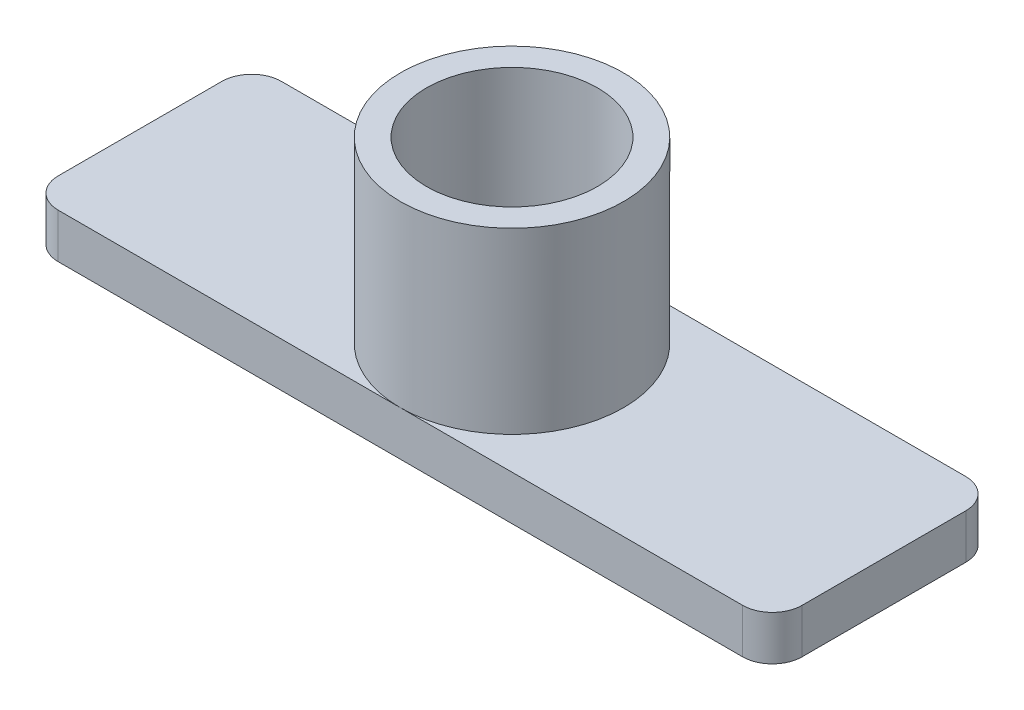
ISO-10303-21;
HEADER;
FILE_DESCRIPTION(('STEP AP214'),'2;1');
FILE_NAME('part.step','',(''),(''),'','','');
FILE_SCHEMA(('AUTOMOTIVE_DESIGN { 1 0 10303 214 1 1 1 1 }'));
ENDSEC;
DATA;
#1=APPLICATION_CONTEXT('core data for automotive mechanical design processes');
#2=APPLICATION_PROTOCOL_DEFINITION('international standard','automotive_design',2000,#1);
#3=PRODUCT_CONTEXT('',#1,'mechanical');
#4=PRODUCT('Part','Part','',(#3));
#5=PRODUCT_RELATED_PRODUCT_CATEGORY('part','',(#4));
#6=PRODUCT_DEFINITION_FORMATION('','',#4);
#7=PRODUCT_DEFINITION_CONTEXT('part definition',#1,'design');
#8=PRODUCT_DEFINITION('design','',#6,#7);
#9=PRODUCT_DEFINITION_SHAPE('','',#8);
#10=(LENGTH_UNIT() NAMED_UNIT(*) SI_UNIT(.MILLI.,.METRE.));
#11=(NAMED_UNIT(*) PLANE_ANGLE_UNIT() SI_UNIT($,.RADIAN.));
#12=(NAMED_UNIT(*) SI_UNIT($,.STERADIAN.) SOLID_ANGLE_UNIT());
#13=UNCERTAINTY_MEASURE_WITH_UNIT(LENGTH_MEASURE(1.E-05),#10,'distance_accuracy_value','');
#14=(GEOMETRIC_REPRESENTATION_CONTEXT(3) GLOBAL_UNCERTAINTY_ASSIGNED_CONTEXT((#13)) GLOBAL_UNIT_ASSIGNED_CONTEXT((#10,
#11,#12)) REPRESENTATION_CONTEXT('',''));
#15=CARTESIAN_POINT('',(0.,0.,0.));
#16=DIRECTION('',(0.,0.,1.));
#17=DIRECTION('',(1.,0.,0.));
#18=AXIS2_PLACEMENT_3D('',#15,#16,#17);
#19=CARTESIAN_POINT('',(0.,3.,0.));
#20=DIRECTION('',(0.,-1.,0.));
#21=DIRECTION('',(0.,0.,-1.));
#22=AXIS2_PLACEMENT_3D('',#19,#20,#21);
#23=PLANE('',#22);
#24=DIRECTION('',(0.,0.,-1.));
#25=VECTOR('',#24,1.);
#26=CARTESIAN_POINT('',(25.,3.,7.5));
#27=LINE('',#26,#25);
#28=CARTESIAN_POINT('',(25.,3.,5.5));
#29=VERTEX_POINT('',#28);
#30=CARTESIAN_POINT('',(25.,3.,-5.5));
#31=VERTEX_POINT('',#30);
#32=EDGE_CURVE('E140',#29,#31,#27,.T.);
#33=ORIENTED_EDGE('',*,*,#32,.T.);
#34=CARTESIAN_POINT('',(23.,3.,-5.5));
#35=DIRECTION('',(0.,-1.,0.));
#36=DIRECTION('',(0.,0.,-1.));
#37=AXIS2_PLACEMENT_3D('',#34,#35,#36);
#38=CIRCLE('',#37,2.);
#39=CARTESIAN_POINT('',(23.,3.,-7.5));
#40=VERTEX_POINT('',#39);
#41=EDGE_CURVE('E172',#31,#40,#38,.F.);
#42=ORIENTED_EDGE('',*,*,#41,.T.);
#43=DIRECTION('',(-1.,0.,0.));
#44=VECTOR('',#43,1.);
#45=CARTESIAN_POINT('',(-25.,3.,-7.5));
#46=LINE('',#45,#44);
#47=CARTESIAN_POINT('',(0.,3.,-7.5));
#48=VERTEX_POINT('',#47);
#49=EDGE_CURVE('E128',#40,#48,#46,.T.);
#50=ORIENTED_EDGE('',*,*,#49,.T.);
#51=CARTESIAN_POINT('',(0.,3.,0.));
#52=DIRECTION('',(0.,1.,0.));
#53=DIRECTION('',(0.,0.,1.));
#54=AXIS2_PLACEMENT_3D('',#51,#52,#53);
#55=CIRCLE('',#54,7.5);
#56=CARTESIAN_POINT('',(0.,3.,7.5));
#57=VERTEX_POINT('',#56);
#58=EDGE_CURVE('E125',#57,#48,#55,.T.);
#59=ORIENTED_EDGE('',*,*,#58,.F.);
#60=DIRECTION('',(1.,0.,0.));
#61=VECTOR('',#60,1.);
#62=CARTESIAN_POINT('',(-25.,3.,7.5));
#63=LINE('',#62,#61);
#64=CARTESIAN_POINT('',(23.,3.,7.5));
#65=VERTEX_POINT('',#64);
#66=EDGE_CURVE('E113',#57,#65,#63,.T.);
#67=ORIENTED_EDGE('',*,*,#66,.T.);
#68=CARTESIAN_POINT('',(23.,3.,5.5));
#69=DIRECTION('',(0.,-1.,0.));
#70=DIRECTION('',(0.,0.,-1.));
#71=AXIS2_PLACEMENT_3D('',#68,#69,#70);
#72=CIRCLE('',#71,2.);
#73=EDGE_CURVE('E170',#65,#29,#72,.F.);
#74=ORIENTED_EDGE('',*,*,#73,.T.);
#75=EDGE_LOOP('',(#33,#42,#50,#59,#67,#74));
#76=FACE_BOUND('',#75,.T.);
#77=ADVANCED_FACE('F33',(#76),#23,.F.);
#78=CARTESIAN_POINT('',(25.,3.,7.5));
#79=DIRECTION('',(-1.,0.,0.));
#80=DIRECTION('',(0.,0.,1.));
#81=AXIS2_PLACEMENT_3D('',#78,#79,#80);
#82=PLANE('',#81);
#83=DIRECTION('',(0.,0.,-1.));
#84=VECTOR('',#83,1.);
#85=CARTESIAN_POINT('',(25.,0.,7.5));
#86=LINE('',#85,#84);
#87=CARTESIAN_POINT('',(25.,0.,5.5));
#88=VERTEX_POINT('',#87);
#89=CARTESIAN_POINT('',(25.,0.,-5.5));
#90=VERTEX_POINT('',#89);
#91=EDGE_CURVE('E146',#88,#90,#86,.T.);
#92=ORIENTED_EDGE('',*,*,#91,.T.);
#93=DIRECTION('',(0.,-1.,0.));
#94=VECTOR('',#93,1.);
#95=CARTESIAN_POINT('',(25.,3.,-5.5));
#96=LINE('',#95,#94);
#97=EDGE_CURVE('E168',#90,#31,#96,.F.);
#98=ORIENTED_EDGE('',*,*,#97,.T.);
#99=ORIENTED_EDGE('',*,*,#32,.F.);
#100=DIRECTION('',(0.,-1.,0.));
#101=VECTOR('',#100,1.);
#102=CARTESIAN_POINT('',(25.,3.,5.5));
#103=LINE('',#102,#101);
#104=EDGE_CURVE('E165',#29,#88,#103,.T.);
#105=ORIENTED_EDGE('',*,*,#104,.T.);
#106=EDGE_LOOP('',(#92,#98,#99,#105));
#107=FACE_BOUND('',#106,.T.);
#108=ADVANCED_FACE('F196',(#107),#82,.F.);
#109=CARTESIAN_POINT('',(-25.,3.,-7.5));
#110=DIRECTION('',(0.,0.,1.));
#111=DIRECTION('',(1.,0.,0.));
#112=AXIS2_PLACEMENT_3D('',#109,#110,#111);
#113=PLANE('',#112);
#114=ORIENTED_EDGE('',*,*,#49,.F.);
#115=DIRECTION('',(0.,-1.,0.));
#116=VECTOR('',#115,1.);
#117=CARTESIAN_POINT('',(23.,3.,-7.5));
#118=LINE('',#117,#116);
#119=CARTESIAN_POINT('',(23.,0.,-7.5));
#120=VERTEX_POINT('',#119);
#121=EDGE_CURVE('E135',#40,#120,#118,.T.);
#122=ORIENTED_EDGE('',*,*,#121,.T.);
#123=DIRECTION('',(-1.,0.,0.));
#124=VECTOR('',#123,1.);
#125=CARTESIAN_POINT('',(-25.,0.,-7.5));
#126=LINE('',#125,#124);
#127=CARTESIAN_POINT('',(-23.,0.,-7.5));
#128=VERTEX_POINT('',#127);
#129=EDGE_CURVE('E149',#120,#128,#126,.T.);
#130=ORIENTED_EDGE('',*,*,#129,.T.);
#131=DIRECTION('',(0.,-1.,0.));
#132=VECTOR('',#131,1.);
#133=CARTESIAN_POINT('',(-23.,3.,-7.5));
#134=LINE('',#133,#132);
#135=CARTESIAN_POINT('',(-23.,3.,-7.5));
#136=VERTEX_POINT('',#135);
#137=EDGE_CURVE('E134',#128,#136,#134,.F.);
#138=ORIENTED_EDGE('',*,*,#137,.T.);
#139=EDGE_CURVE('E142',#48,#136,#46,.T.);
#140=ORIENTED_EDGE('',*,*,#139,.F.);
#141=EDGE_LOOP('',(#114,#122,#130,#138,#140));
#142=FACE_BOUND('',#141,.T.);
#143=ADVANCED_FACE('F203',(#142),#113,.F.);
#144=CARTESIAN_POINT('',(-25.,3.,7.5));
#145=DIRECTION('',(1.,0.,0.));
#146=DIRECTION('',(0.,0.,-1.));
#147=AXIS2_PLACEMENT_3D('',#144,#145,#146);
#148=PLANE('',#147);
#149=DIRECTION('',(0.,0.,1.));
#150=VECTOR('',#149,1.);
#151=CARTESIAN_POINT('',(-25.,0.,7.5));
#152=LINE('',#151,#150);
#153=CARTESIAN_POINT('',(-25.,0.,-5.5));
#154=VERTEX_POINT('',#153);
#155=CARTESIAN_POINT('',(-25.,0.,5.5));
#156=VERTEX_POINT('',#155);
#157=EDGE_CURVE('E152',#154,#156,#152,.T.);
#158=ORIENTED_EDGE('',*,*,#157,.T.);
#159=DIRECTION('',(0.,-1.,0.));
#160=VECTOR('',#159,1.);
#161=CARTESIAN_POINT('',(-25.,3.,5.5));
#162=LINE('',#161,#160);
#163=CARTESIAN_POINT('',(-25.,3.,5.5));
#164=VERTEX_POINT('',#163);
#165=EDGE_CURVE('E48',#156,#164,#162,.F.);
#166=ORIENTED_EDGE('',*,*,#165,.T.);
#167=DIRECTION('',(0.,0.,1.));
#168=VECTOR('',#167,1.);
#169=CARTESIAN_POINT('',(-25.,3.,7.5));
#170=LINE('',#169,#168);
#171=CARTESIAN_POINT('',(-25.,3.,-5.5));
#172=VERTEX_POINT('',#171);
#173=EDGE_CURVE('E123',#172,#164,#170,.T.);
#174=ORIENTED_EDGE('',*,*,#173,.F.);
#175=DIRECTION('',(0.,-1.,0.));
#176=VECTOR('',#175,1.);
#177=CARTESIAN_POINT('',(-25.,3.,-5.5));
#178=LINE('',#177,#176);
#179=EDGE_CURVE('E177',#172,#154,#178,.T.);
#180=ORIENTED_EDGE('',*,*,#179,.T.);
#181=EDGE_LOOP('',(#158,#166,#174,#180));
#182=FACE_BOUND('',#181,.T.);
#183=ADVANCED_FACE('F182',(#182),#148,.F.);
#184=CARTESIAN_POINT('',(-25.,3.,7.5));
#185=DIRECTION('',(0.,0.,-1.));
#186=DIRECTION('',(-1.,0.,0.));
#187=AXIS2_PLACEMENT_3D('',#184,#185,#186);
#188=PLANE('',#187);
#189=DIRECTION('',(1.,0.,0.));
#190=VECTOR('',#189,1.);
#191=CARTESIAN_POINT('',(-25.,0.,7.5));
#192=LINE('',#191,#190);
#193=CARTESIAN_POINT('',(-23.,0.,7.5));
#194=VERTEX_POINT('',#193);
#195=CARTESIAN_POINT('',(23.,0.,7.5));
#196=VERTEX_POINT('',#195);
#197=EDGE_CURVE('E143',#194,#196,#192,.T.);
#198=ORIENTED_EDGE('',*,*,#197,.T.);
#199=DIRECTION('',(0.,-1.,0.));
#200=VECTOR('',#199,1.);
#201=CARTESIAN_POINT('',(23.,3.,7.5));
#202=LINE('',#201,#200);
#203=EDGE_CURVE('E120',#196,#65,#202,.F.);
#204=ORIENTED_EDGE('',*,*,#203,.T.);
#205=ORIENTED_EDGE('',*,*,#66,.F.);
#206=CARTESIAN_POINT('',(-23.,3.,7.5));
#207=VERTEX_POINT('',#206);
#208=EDGE_CURVE('E103',#207,#57,#63,.T.);
#209=ORIENTED_EDGE('',*,*,#208,.F.);
#210=DIRECTION('',(0.,-1.,0.));
#211=VECTOR('',#210,1.);
#212=CARTESIAN_POINT('',(-23.,3.,7.5));
#213=LINE('',#212,#211);
#214=EDGE_CURVE('E174',#207,#194,#213,.T.);
#215=ORIENTED_EDGE('',*,*,#214,.T.);
#216=EDGE_LOOP('',(#198,#204,#205,#209,#215));
#217=FACE_BOUND('',#216,.T.);
#218=ADVANCED_FACE('F118',(#217),#188,.F.);
#219=ORIENTED_EDGE('',*,*,#173,.T.);
#220=CARTESIAN_POINT('',(-23.,3.,5.5));
#221=DIRECTION('',(0.,-1.,0.));
#222=DIRECTION('',(0.,0.,-1.));
#223=AXIS2_PLACEMENT_3D('',#220,#221,#222);
#224=CIRCLE('',#223,2.);
#225=EDGE_CURVE('E11',#164,#207,#224,.F.);
#226=ORIENTED_EDGE('',*,*,#225,.T.);
#227=ORIENTED_EDGE('',*,*,#208,.T.);
#228=EDGE_CURVE('E107',#48,#57,#55,.T.);
#229=ORIENTED_EDGE('',*,*,#228,.F.);
#230=ORIENTED_EDGE('',*,*,#139,.T.);
#231=CARTESIAN_POINT('',(-23.,3.,-5.5));
#232=DIRECTION('',(0.,-1.,0.));
#233=DIRECTION('',(0.,0.,-1.));
#234=AXIS2_PLACEMENT_3D('',#231,#232,#233);
#235=CIRCLE('',#234,2.);
#236=EDGE_CURVE('E41',#136,#172,#235,.F.);
#237=ORIENTED_EDGE('',*,*,#236,.T.);
#238=EDGE_LOOP('',(#219,#226,#227,#229,#230,#237));
#239=FACE_BOUND('',#238,.T.);
#240=ADVANCED_FACE('F105',(#239),#23,.F.);
#241=CARTESIAN_POINT('',(0.,0.,0.));
#242=DIRECTION('',(0.,-1.,0.));
#243=DIRECTION('',(0.,0.,-1.));
#244=AXIS2_PLACEMENT_3D('',#241,#242,#243);
#245=PLANE('',#244);
#246=ORIENTED_EDGE('',*,*,#129,.F.);
#247=CARTESIAN_POINT('',(23.,0.,-5.5));
#248=DIRECTION('',(0.,-1.,0.));
#249=DIRECTION('',(0.,0.,-1.));
#250=AXIS2_PLACEMENT_3D('',#247,#248,#249);
#251=CIRCLE('',#250,2.);
#252=EDGE_CURVE('E163',#120,#90,#251,.T.);
#253=ORIENTED_EDGE('',*,*,#252,.T.);
#254=ORIENTED_EDGE('',*,*,#91,.F.);
#255=CARTESIAN_POINT('',(23.,0.,5.5));
#256=DIRECTION('',(0.,-1.,0.));
#257=DIRECTION('',(0.,0.,-1.));
#258=AXIS2_PLACEMENT_3D('',#255,#256,#257);
#259=CIRCLE('',#258,2.);
#260=EDGE_CURVE('E161',#88,#196,#259,.T.);
#261=ORIENTED_EDGE('',*,*,#260,.T.);
#262=ORIENTED_EDGE('',*,*,#197,.F.);
#263=CARTESIAN_POINT('',(-23.,0.,5.5));
#264=DIRECTION('',(0.,-1.,0.));
#265=DIRECTION('',(0.,0.,-1.));
#266=AXIS2_PLACEMENT_3D('',#263,#264,#265);
#267=CIRCLE('',#266,2.);
#268=EDGE_CURVE('E159',#194,#156,#267,.T.);
#269=ORIENTED_EDGE('',*,*,#268,.T.);
#270=ORIENTED_EDGE('',*,*,#157,.F.);
#271=CARTESIAN_POINT('',(-23.,0.,-5.5));
#272=DIRECTION('',(0.,-1.,0.));
#273=DIRECTION('',(0.,0.,-1.));
#274=AXIS2_PLACEMENT_3D('',#271,#272,#273);
#275=CIRCLE('',#274,2.);
#276=EDGE_CURVE('E157',#154,#128,#275,.T.);
#277=ORIENTED_EDGE('',*,*,#276,.T.);
#278=EDGE_LOOP('',(#246,#253,#254,#261,#262,#269,#270,#277));
#279=FACE_BOUND('',#278,.T.);
#280=ADVANCED_FACE('F186',(#279),#245,.T.);
#281=CARTESIAN_POINT('',(0.,15.,0.));
#282=DIRECTION('',(0.,1.,0.));
#283=DIRECTION('',(0.,0.,1.));
#284=AXIS2_PLACEMENT_3D('',#281,#282,#283);
#285=PLANE('',#284);
#286=CARTESIAN_POINT('',(0.,15.,0.));
#287=DIRECTION('',(0.,1.,0.));
#288=DIRECTION('',(0.,0.,1.));
#289=AXIS2_PLACEMENT_3D('',#286,#287,#288);
#290=CIRCLE('',#289,7.5);
#291=CARTESIAN_POINT('',(0.,15.,7.5));
#292=VERTEX_POINT('',#291);
#293=EDGE_CURVE('E130',#292,#292,#290,.T.);
#294=ORIENTED_EDGE('',*,*,#293,.T.);
#295=EDGE_LOOP('',(#294));
#296=FACE_BOUND('',#295,.T.);
#297=CARTESIAN_POINT('',(0.,15.,0.));
#298=DIRECTION('',(0.,1.,0.));
#299=DIRECTION('',(0.,0.,1.));
#300=AXIS2_PLACEMENT_3D('',#297,#298,#299);
#301=CIRCLE('',#300,5.75);
#302=CARTESIAN_POINT('',(0.,15.,5.75));
#303=VERTEX_POINT('',#302);
#304=EDGE_CURVE('E131',#303,#303,#301,.T.);
#305=ORIENTED_EDGE('',*,*,#304,.F.);
#306=EDGE_LOOP('',(#305));
#307=FACE_BOUND('',#306,.T.);
#308=ADVANCED_FACE('F226',(#296,#307),#285,.T.);
#309=CARTESIAN_POINT('',(0.,15.,0.));
#310=DIRECTION('',(0.,-1.,0.));
#311=DIRECTION('',(0.,0.,-1.));
#312=AXIS2_PLACEMENT_3D('',#309,#310,#311);
#313=CYLINDRICAL_SURFACE('',#312,7.5);
#314=ORIENTED_EDGE('',*,*,#293,.F.);
#315=EDGE_LOOP('',(#314));
#316=FACE_BOUND('',#315,.T.);
#317=ORIENTED_EDGE('',*,*,#58,.T.);
#318=ORIENTED_EDGE('',*,*,#228,.T.);
#319=EDGE_LOOP('',(#317,#318));
#320=FACE_BOUND('',#319,.T.);
#321=ADVANCED_FACE('F133',(#316,#320),#313,.T.);
#322=CARTESIAN_POINT('',(0.,15.,0.));
#323=DIRECTION('',(0.,-1.,0.));
#324=DIRECTION('',(0.,0.,-1.));
#325=AXIS2_PLACEMENT_3D('',#322,#323,#324);
#326=CYLINDRICAL_SURFACE('',#325,5.75);
#327=ORIENTED_EDGE('',*,*,#304,.T.);
#328=EDGE_LOOP('',(#327));
#329=FACE_BOUND('',#328,.T.);
#330=CARTESIAN_POINT('',(0.,3.,0.));
#331=DIRECTION('',(0.,1.,0.));
#332=DIRECTION('',(0.,0.,1.));
#333=AXIS2_PLACEMENT_3D('',#330,#331,#332);
#334=CIRCLE('',#333,5.75);
#335=CARTESIAN_POINT('',(0.,3.,5.75));
#336=VERTEX_POINT('',#335);
#337=EDGE_CURVE('E333',#336,#336,#334,.T.);
#338=ORIENTED_EDGE('',*,*,#337,.F.);
#339=EDGE_LOOP('',(#338));
#340=FACE_BOUND('',#339,.T.);
#341=ADVANCED_FACE('F219',(#329,#340),#326,.F.);
#342=ORIENTED_EDGE('',*,*,#337,.T.);
#343=EDGE_LOOP('',(#342));
#344=FACE_BOUND('',#343,.T.);
#345=ADVANCED_FACE('F211',(#344),#23,.F.);
#346=CARTESIAN_POINT('',(23.,3.,-5.5));
#347=DIRECTION('',(0.,-1.,0.));
#348=DIRECTION('',(0.,0.,-1.));
#349=AXIS2_PLACEMENT_3D('',#346,#347,#348);
#350=CYLINDRICAL_SURFACE('',#349,2.);
#351=ORIENTED_EDGE('',*,*,#41,.F.);
#352=ORIENTED_EDGE('',*,*,#97,.F.);
#353=ORIENTED_EDGE('',*,*,#252,.F.);
#354=ORIENTED_EDGE('',*,*,#121,.F.);
#355=EDGE_LOOP('',(#351,#352,#353,#354));
#356=FACE_BOUND('',#355,.T.);
#357=ADVANCED_FACE('F200',(#356),#350,.T.);
#358=CARTESIAN_POINT('',(23.,3.,5.5));
#359=DIRECTION('',(0.,-1.,0.));
#360=DIRECTION('',(0.,0.,-1.));
#361=AXIS2_PLACEMENT_3D('',#358,#359,#360);
#362=CYLINDRICAL_SURFACE('',#361,2.);
#363=ORIENTED_EDGE('',*,*,#73,.F.);
#364=ORIENTED_EDGE('',*,*,#203,.F.);
#365=ORIENTED_EDGE('',*,*,#260,.F.);
#366=ORIENTED_EDGE('',*,*,#104,.F.);
#367=EDGE_LOOP('',(#363,#364,#365,#366));
#368=FACE_BOUND('',#367,.T.);
#369=ADVANCED_FACE('F191',(#368),#362,.T.);
#370=CARTESIAN_POINT('',(-23.,3.,5.5));
#371=DIRECTION('',(0.,-1.,0.));
#372=DIRECTION('',(0.,0.,-1.));
#373=AXIS2_PLACEMENT_3D('',#370,#371,#372);
#374=CYLINDRICAL_SURFACE('',#373,2.);
#375=ORIENTED_EDGE('',*,*,#225,.F.);
#376=ORIENTED_EDGE('',*,*,#165,.F.);
#377=ORIENTED_EDGE('',*,*,#268,.F.);
#378=ORIENTED_EDGE('',*,*,#214,.F.);
#379=EDGE_LOOP('',(#375,#376,#377,#378));
#380=FACE_BOUND('',#379,.T.);
#381=ADVANCED_FACE('F189',(#380),#374,.T.);
#382=CARTESIAN_POINT('',(-23.,3.,-5.5));
#383=DIRECTION('',(0.,-1.,0.));
#384=DIRECTION('',(0.,0.,-1.));
#385=AXIS2_PLACEMENT_3D('',#382,#383,#384);
#386=CYLINDRICAL_SURFACE('',#385,2.);
#387=ORIENTED_EDGE('',*,*,#236,.F.);
#388=ORIENTED_EDGE('',*,*,#137,.F.);
#389=ORIENTED_EDGE('',*,*,#276,.F.);
#390=ORIENTED_EDGE('',*,*,#179,.F.);
#391=EDGE_LOOP('',(#387,#388,#389,#390));
#392=FACE_BOUND('',#391,.T.);
#393=ADVANCED_FACE('F35',(#392),#386,.T.);
#394=CLOSED_SHELL('',(#77,#108,#143,#183,#218,#240,#280,#308,#321,#341,#345,#357,#369,#381,#393));
#395=MANIFOLD_SOLID_BREP('B2',#394);
#396=ADVANCED_BREP_SHAPE_REPRESENTATION('',(#18,#395),#14);
#397=SHAPE_DEFINITION_REPRESENTATION(#9,#396);
ENDSEC;
END-ISO-10303-21;
